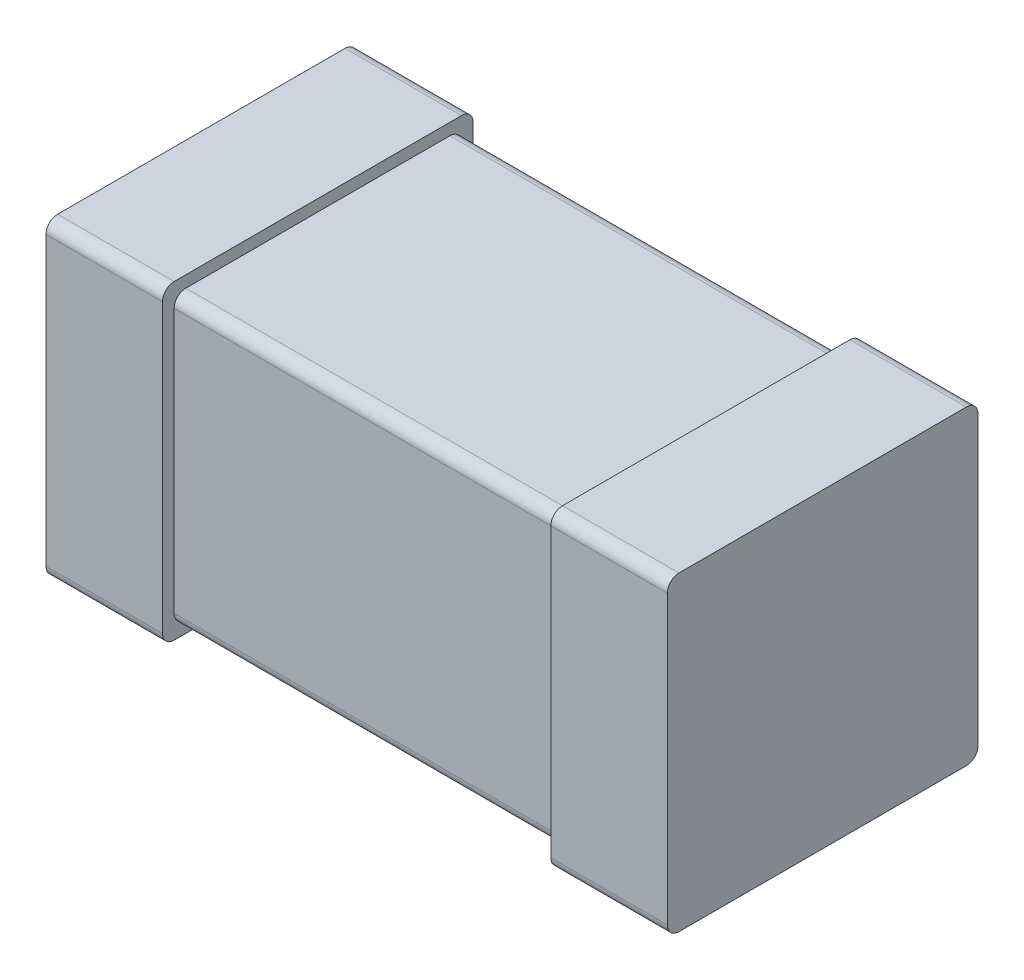
ISO-10303-21;
HEADER;
FILE_DESCRIPTION(('STEP AP214'),'2;1');
FILE_NAME('part.step','',(''),(''),'','','');
FILE_SCHEMA(('AUTOMOTIVE_DESIGN { 1 0 10303 214 1 1 1 1 }'));
ENDSEC;
DATA;
#1=APPLICATION_CONTEXT('core data for automotive mechanical design processes');
#2=APPLICATION_PROTOCOL_DEFINITION('international standard','automotive_design',2000,#1);
#3=PRODUCT_CONTEXT('',#1,'mechanical');
#4=PRODUCT('Part','Part','',(#3));
#5=PRODUCT_RELATED_PRODUCT_CATEGORY('part','',(#4));
#6=PRODUCT_DEFINITION_FORMATION('','',#4);
#7=PRODUCT_DEFINITION_CONTEXT('part definition',#1,'design');
#8=PRODUCT_DEFINITION('design','',#6,#7);
#9=PRODUCT_DEFINITION_SHAPE('','',#8);
#10=(LENGTH_UNIT() NAMED_UNIT(*) SI_UNIT(.MILLI.,.METRE.));
#11=(NAMED_UNIT(*) PLANE_ANGLE_UNIT() SI_UNIT($,.RADIAN.));
#12=(NAMED_UNIT(*) SI_UNIT($,.STERADIAN.) SOLID_ANGLE_UNIT());
#13=UNCERTAINTY_MEASURE_WITH_UNIT(LENGTH_MEASURE(1.E-05),#10,'distance_accuracy_value','');
#14=(GEOMETRIC_REPRESENTATION_CONTEXT(3) GLOBAL_UNCERTAINTY_ASSIGNED_CONTEXT((#13)) GLOBAL_UNIT_ASSIGNED_CONTEXT((#10,
#11,#12)) REPRESENTATION_CONTEXT('',''));
#15=CARTESIAN_POINT('',(0.,0.,0.));
#16=DIRECTION('',(0.,0.,1.));
#17=DIRECTION('',(1.,0.,0.));
#18=AXIS2_PLACEMENT_3D('',#15,#16,#17);
#19=CARTESIAN_POINT('',(-0.8,-0.4,0.));
#20=DIRECTION('',(1.,0.,0.));
#21=DIRECTION('',(0.,0.,-1.));
#22=AXIS2_PLACEMENT_3D('',#19,#20,#21);
#23=PLANE('',#22);
#24=DIRECTION('',(0.,1.,0.));
#25=VECTOR('',#24,1.);
#26=CARTESIAN_POINT('',(-0.8,-0.4,0.8));
#27=LINE('',#26,#25);
#28=CARTESIAN_POINT('',(-0.8,0.37,0.8));
#29=VERTEX_POINT('',#28);
#30=CARTESIAN_POINT('',(-0.8,-0.37,0.8));
#31=VERTEX_POINT('',#30);
#32=EDGE_CURVE('E300',#29,#31,#27,.F.);
#33=ORIENTED_EDGE('',*,*,#32,.F.);
#34=CARTESIAN_POINT('',(-0.8,0.37,0.77));
#35=DIRECTION('',(1.,0.,0.));
#36=DIRECTION('',(0.,0.,-1.));
#37=AXIS2_PLACEMENT_3D('',#34,#35,#36);
#38=CIRCLE('',#37,0.03);
#39=CARTESIAN_POINT('',(-0.8,0.4,0.77));
#40=VERTEX_POINT('',#39);
#41=EDGE_CURVE('E279',#40,#29,#38,.T.);
#42=ORIENTED_EDGE('',*,*,#41,.F.);
#43=DIRECTION('',(0.,0.,1.));
#44=VECTOR('',#43,1.);
#45=CARTESIAN_POINT('',(-0.8,0.4,0.));
#46=LINE('',#45,#44);
#47=CARTESIAN_POINT('',(-0.8,0.4,0.03));
#48=VERTEX_POINT('',#47);
#49=EDGE_CURVE('E201',#48,#40,#46,.T.);
#50=ORIENTED_EDGE('',*,*,#49,.F.);
#51=CARTESIAN_POINT('',(-0.8,0.37,0.03));
#52=DIRECTION('',(1.,0.,0.));
#53=DIRECTION('',(0.,0.,-1.));
#54=AXIS2_PLACEMENT_3D('',#51,#52,#53);
#55=CIRCLE('',#54,0.03);
#56=CARTESIAN_POINT('',(-0.8,0.37,0.));
#57=VERTEX_POINT('',#56);
#58=EDGE_CURVE('E196',#57,#48,#55,.T.);
#59=ORIENTED_EDGE('',*,*,#58,.F.);
#60=DIRECTION('',(0.,1.,0.));
#61=VECTOR('',#60,1.);
#62=CARTESIAN_POINT('',(-0.8,-0.4,0.));
#63=LINE('',#62,#61);
#64=CARTESIAN_POINT('',(-0.8,-0.37,0.));
#65=VERTEX_POINT('',#64);
#66=EDGE_CURVE('E188',#57,#65,#63,.F.);
#67=ORIENTED_EDGE('',*,*,#66,.T.);
#68=CARTESIAN_POINT('',(-0.8,-0.37,0.03));
#69=DIRECTION('',(1.,0.,0.));
#70=DIRECTION('',(0.,0.,-1.));
#71=AXIS2_PLACEMENT_3D('',#68,#69,#70);
#72=CIRCLE('',#71,0.03);
#73=CARTESIAN_POINT('',(-0.8,-0.4,0.03));
#74=VERTEX_POINT('',#73);
#75=EDGE_CURVE('E20',#74,#65,#72,.T.);
#76=ORIENTED_EDGE('',*,*,#75,.F.);
#77=DIRECTION('',(0.,0.,1.));
#78=VECTOR('',#77,1.);
#79=CARTESIAN_POINT('',(-0.8,-0.4,0.));
#80=LINE('',#79,#78);
#81=CARTESIAN_POINT('',(-0.8,-0.4,0.77));
#82=VERTEX_POINT('',#81);
#83=EDGE_CURVE('E171',#74,#82,#80,.T.);
#84=ORIENTED_EDGE('',*,*,#83,.T.);
#85=CARTESIAN_POINT('',(-0.8,-0.37,0.77));
#86=DIRECTION('',(1.,0.,0.));
#87=DIRECTION('',(0.,0.,-1.));
#88=AXIS2_PLACEMENT_3D('',#85,#86,#87);
#89=CIRCLE('',#88,0.03);
#90=EDGE_CURVE('E275',#31,#82,#89,.T.);
#91=ORIENTED_EDGE('',*,*,#90,.F.);
#92=EDGE_LOOP('',(#33,#42,#50,#59,#67,#76,#84,#91));
#93=FACE_BOUND('',#92,.T.);
#94=ADVANCED_FACE('F17',(#93),#23,.F.);
#95=CARTESIAN_POINT('',(0.8,-0.4,0.));
#96=DIRECTION('',(1.,0.,0.));
#97=DIRECTION('',(0.,0.,-1.));
#98=AXIS2_PLACEMENT_3D('',#95,#96,#97);
#99=PLANE('',#98);
#100=DIRECTION('',(0.,1.,0.));
#101=VECTOR('',#100,1.);
#102=CARTESIAN_POINT('',(0.8,-0.4,0.8));
#103=LINE('',#102,#101);
#104=CARTESIAN_POINT('',(0.8,-0.37,0.8));
#105=VERTEX_POINT('',#104);
#106=CARTESIAN_POINT('',(0.8,0.37,0.8));
#107=VERTEX_POINT('',#106);
#108=EDGE_CURVE('E290',#105,#107,#103,.T.);
#109=ORIENTED_EDGE('',*,*,#108,.F.);
#110=CARTESIAN_POINT('',(0.8,-0.37,0.77));
#111=DIRECTION('',(1.,0.,0.));
#112=DIRECTION('',(0.,0.,-1.));
#113=AXIS2_PLACEMENT_3D('',#110,#111,#112);
#114=CIRCLE('',#113,0.03);
#115=CARTESIAN_POINT('',(0.8,-0.4,0.77));
#116=VERTEX_POINT('',#115);
#117=EDGE_CURVE('E259',#116,#105,#114,.F.);
#118=ORIENTED_EDGE('',*,*,#117,.F.);
#119=DIRECTION('',(0.,0.,1.));
#120=VECTOR('',#119,1.);
#121=CARTESIAN_POINT('',(0.8,-0.4,0.));
#122=LINE('',#121,#120);
#123=CARTESIAN_POINT('',(0.8,-0.4,0.03));
#124=VERTEX_POINT('',#123);
#125=EDGE_CURVE('E274',#116,#124,#122,.F.);
#126=ORIENTED_EDGE('',*,*,#125,.T.);
#127=CARTESIAN_POINT('',(0.8,-0.37,0.03));
#128=DIRECTION('',(1.,0.,0.));
#129=DIRECTION('',(0.,0.,-1.));
#130=AXIS2_PLACEMENT_3D('',#127,#128,#129);
#131=CIRCLE('',#130,0.03);
#132=CARTESIAN_POINT('',(0.8,-0.37,0.));
#133=VERTEX_POINT('',#132);
#134=EDGE_CURVE('E271',#133,#124,#131,.F.);
#135=ORIENTED_EDGE('',*,*,#134,.F.);
#136=DIRECTION('',(0.,1.,0.));
#137=VECTOR('',#136,1.);
#138=CARTESIAN_POINT('',(0.8,-0.4,0.));
#139=LINE('',#138,#137);
#140=CARTESIAN_POINT('',(0.8,0.37,0.));
#141=VERTEX_POINT('',#140);
#142=EDGE_CURVE('E270',#133,#141,#139,.T.);
#143=ORIENTED_EDGE('',*,*,#142,.T.);
#144=CARTESIAN_POINT('',(0.8,0.37,0.03));
#145=DIRECTION('',(1.,0.,0.));
#146=DIRECTION('',(0.,0.,-1.));
#147=AXIS2_PLACEMENT_3D('',#144,#145,#146);
#148=CIRCLE('',#147,0.03);
#149=CARTESIAN_POINT('',(0.8,0.4,0.03));
#150=VERTEX_POINT('',#149);
#151=EDGE_CURVE('E267',#150,#141,#148,.F.);
#152=ORIENTED_EDGE('',*,*,#151,.F.);
#153=DIRECTION('',(0.,0.,1.));
#154=VECTOR('',#153,1.);
#155=CARTESIAN_POINT('',(0.8,0.4,0.));
#156=LINE('',#155,#154);
#157=CARTESIAN_POINT('',(0.8,0.4,0.77));
#158=VERTEX_POINT('',#157);
#159=EDGE_CURVE('E295',#158,#150,#156,.F.);
#160=ORIENTED_EDGE('',*,*,#159,.F.);
#161=CARTESIAN_POINT('',(0.8,0.37,0.77));
#162=DIRECTION('',(1.,0.,0.));
#163=DIRECTION('',(0.,0.,-1.));
#164=AXIS2_PLACEMENT_3D('',#161,#162,#163);
#165=CIRCLE('',#164,0.03);
#166=EDGE_CURVE('E263',#107,#158,#165,.F.);
#167=ORIENTED_EDGE('',*,*,#166,.F.);
#168=EDGE_LOOP('',(#109,#118,#126,#135,#143,#152,#160,#167));
#169=FACE_BOUND('',#168,.T.);
#170=ADVANCED_FACE('F444',(#169),#99,.T.);
#171=CARTESIAN_POINT('',(-0.8,-0.4,0.));
#172=DIRECTION('',(0.,1.,0.));
#173=DIRECTION('',(0.,0.,1.));
#174=AXIS2_PLACEMENT_3D('',#171,#172,#173);
#175=PLANE('',#174);
#176=ORIENTED_EDGE('',*,*,#83,.F.);
#177=DIRECTION('',(1.,0.,0.));
#178=VECTOR('',#177,1.);
#179=CARTESIAN_POINT('',(-0.8,-0.4,0.03));
#180=LINE('',#179,#178);
#181=CARTESIAN_POINT('',(-0.5,-0.4,0.03));
#182=VERTEX_POINT('',#181);
#183=EDGE_CURVE('E182',#182,#74,#180,.F.);
#184=ORIENTED_EDGE('',*,*,#183,.F.);
#185=DIRECTION('',(0.,0.,-1.));
#186=VECTOR('',#185,1.);
#187=CARTESIAN_POINT('',(-0.5,-0.4,0.));
#188=LINE('',#187,#186);
#189=CARTESIAN_POINT('',(-0.5,-0.4,0.77));
#190=VERTEX_POINT('',#189);
#191=EDGE_CURVE('E258',#190,#182,#188,.T.);
#192=ORIENTED_EDGE('',*,*,#191,.F.);
#193=DIRECTION('',(1.,0.,0.));
#194=VECTOR('',#193,1.);
#195=CARTESIAN_POINT('',(-0.8,-0.4,0.77));
#196=LINE('',#195,#194);
#197=EDGE_CURVE('E307',#82,#190,#196,.T.);
#198=ORIENTED_EDGE('',*,*,#197,.F.);
#199=EDGE_LOOP('',(#176,#184,#192,#198));
#200=FACE_BOUND('',#199,.T.);
#201=ADVANCED_FACE('F310',(#200),#175,.F.);
#202=CARTESIAN_POINT('',(-0.8,-0.37,0.03));
#203=DIRECTION('',(1.,0.,0.));
#204=DIRECTION('',(0.,0.,-1.));
#205=AXIS2_PLACEMENT_3D('',#202,#203,#204);
#206=CYLINDRICAL_SURFACE('',#205,0.03);
#207=CARTESIAN_POINT('',(-0.5,-0.37,0.03));
#208=DIRECTION('',(1.,0.,0.));
#209=DIRECTION('',(0.,0.,-1.));
#210=AXIS2_PLACEMENT_3D('',#207,#208,#209);
#211=CIRCLE('',#210,0.03);
#212=CARTESIAN_POINT('',(-0.5,-0.37,0.));
#213=VERTEX_POINT('',#212);
#214=EDGE_CURVE('E256',#182,#213,#211,.T.);
#215=ORIENTED_EDGE('',*,*,#214,.F.);
#216=ORIENTED_EDGE('',*,*,#183,.T.);
#217=ORIENTED_EDGE('',*,*,#75,.T.);
#218=DIRECTION('',(1.,0.,0.));
#219=VECTOR('',#218,1.);
#220=CARTESIAN_POINT('',(-0.8,-0.37,0.));
#221=LINE('',#220,#219);
#222=EDGE_CURVE('E180',#65,#213,#221,.T.);
#223=ORIENTED_EDGE('',*,*,#222,.T.);
#224=EDGE_LOOP('',(#215,#216,#217,#223));
#225=FACE_BOUND('',#224,.T.);
#226=ADVANCED_FACE('F179',(#225),#206,.T.);
#227=CARTESIAN_POINT('',(-0.8,-0.4,0.));
#228=DIRECTION('',(0.,0.,1.));
#229=DIRECTION('',(1.,0.,0.));
#230=AXIS2_PLACEMENT_3D('',#227,#228,#229);
#231=PLANE('',#230);
#232=DIRECTION('',(0.,1.,0.));
#233=VECTOR('',#232,1.);
#234=CARTESIAN_POINT('',(-0.5,-0.4,0.));
#235=LINE('',#234,#233);
#236=CARTESIAN_POINT('',(-0.5,0.37,0.));
#237=VERTEX_POINT('',#236);
#238=EDGE_CURVE('E190',#213,#237,#235,.T.);
#239=ORIENTED_EDGE('',*,*,#238,.F.);
#240=ORIENTED_EDGE('',*,*,#222,.F.);
#241=ORIENTED_EDGE('',*,*,#66,.F.);
#242=DIRECTION('',(1.,0.,0.));
#243=VECTOR('',#242,1.);
#244=CARTESIAN_POINT('',(-0.8,0.37,0.));
#245=LINE('',#244,#243);
#246=EDGE_CURVE('E191',#237,#57,#245,.F.);
#247=ORIENTED_EDGE('',*,*,#246,.F.);
#248=EDGE_LOOP('',(#239,#240,#241,#247));
#249=FACE_BOUND('',#248,.T.);
#250=ADVANCED_FACE('F186',(#249),#231,.F.);
#251=CARTESIAN_POINT('',(-0.8,0.37,0.03));
#252=DIRECTION('',(1.,0.,0.));
#253=DIRECTION('',(0.,0.,-1.));
#254=AXIS2_PLACEMENT_3D('',#251,#252,#253);
#255=CYLINDRICAL_SURFACE('',#254,0.03);
#256=ORIENTED_EDGE('',*,*,#246,.T.);
#257=ORIENTED_EDGE('',*,*,#58,.T.);
#258=DIRECTION('',(1.,0.,0.));
#259=VECTOR('',#258,1.);
#260=CARTESIAN_POINT('',(-0.8,0.4,0.03));
#261=LINE('',#260,#259);
#262=CARTESIAN_POINT('',(-0.5,0.4,0.03));
#263=VERTEX_POINT('',#262);
#264=EDGE_CURVE('E281',#263,#48,#261,.F.);
#265=ORIENTED_EDGE('',*,*,#264,.F.);
#266=CARTESIAN_POINT('',(-0.5,0.37,0.03));
#267=DIRECTION('',(1.,0.,0.));
#268=DIRECTION('',(0.,0.,-1.));
#269=AXIS2_PLACEMENT_3D('',#266,#267,#268);
#270=CIRCLE('',#269,0.03);
#271=EDGE_CURVE('E254',#237,#263,#270,.T.);
#272=ORIENTED_EDGE('',*,*,#271,.F.);
#273=EDGE_LOOP('',(#256,#257,#265,#272));
#274=FACE_BOUND('',#273,.T.);
#275=ADVANCED_FACE('F679',(#274),#255,.T.);
#276=CARTESIAN_POINT('',(-0.8,0.4,0.));
#277=DIRECTION('',(0.,1.,0.));
#278=DIRECTION('',(0.,0.,1.));
#279=AXIS2_PLACEMENT_3D('',#276,#277,#278);
#280=PLANE('',#279);
#281=ORIENTED_EDGE('',*,*,#49,.T.);
#282=DIRECTION('',(1.,0.,0.));
#283=VECTOR('',#282,1.);
#284=CARTESIAN_POINT('',(-0.8,0.4,0.77));
#285=LINE('',#284,#283);
#286=CARTESIAN_POINT('',(-0.5,0.4,0.77));
#287=VERTEX_POINT('',#286);
#288=EDGE_CURVE('E280',#287,#40,#285,.F.);
#289=ORIENTED_EDGE('',*,*,#288,.F.);
#290=DIRECTION('',(0.,0.,-1.));
#291=VECTOR('',#290,1.);
#292=CARTESIAN_POINT('',(-0.5,0.4,0.));
#293=LINE('',#292,#291);
#294=EDGE_CURVE('E253',#263,#287,#293,.F.);
#295=ORIENTED_EDGE('',*,*,#294,.F.);
#296=ORIENTED_EDGE('',*,*,#264,.T.);
#297=EDGE_LOOP('',(#281,#289,#295,#296));
#298=FACE_BOUND('',#297,.T.);
#299=ADVANCED_FACE('F671',(#298),#280,.T.);
#300=CARTESIAN_POINT('',(-0.8,0.37,0.77));
#301=DIRECTION('',(1.,0.,0.));
#302=DIRECTION('',(0.,0.,-1.));
#303=AXIS2_PLACEMENT_3D('',#300,#301,#302);
#304=CYLINDRICAL_SURFACE('',#303,0.03);
#305=CARTESIAN_POINT('',(-0.5,0.37,0.77));
#306=DIRECTION('',(1.,0.,0.));
#307=DIRECTION('',(0.,0.,-1.));
#308=AXIS2_PLACEMENT_3D('',#305,#306,#307);
#309=CIRCLE('',#308,0.03);
#310=CARTESIAN_POINT('',(-0.5,0.37,0.8));
#311=VERTEX_POINT('',#310);
#312=EDGE_CURVE('E251',#287,#311,#309,.T.);
#313=ORIENTED_EDGE('',*,*,#312,.F.);
#314=ORIENTED_EDGE('',*,*,#288,.T.);
#315=ORIENTED_EDGE('',*,*,#41,.T.);
#316=DIRECTION('',(1.,0.,0.));
#317=VECTOR('',#316,1.);
#318=CARTESIAN_POINT('',(-0.8,0.37,0.8));
#319=LINE('',#318,#317);
#320=EDGE_CURVE('E301',#311,#29,#319,.F.);
#321=ORIENTED_EDGE('',*,*,#320,.F.);
#322=EDGE_LOOP('',(#313,#314,#315,#321));
#323=FACE_BOUND('',#322,.T.);
#324=ADVANCED_FACE('F322',(#323),#304,.T.);
#325=CARTESIAN_POINT('',(-0.8,-0.4,0.8));
#326=DIRECTION('',(0.,0.,1.));
#327=DIRECTION('',(1.,0.,0.));
#328=AXIS2_PLACEMENT_3D('',#325,#326,#327);
#329=PLANE('',#328);
#330=DIRECTION('',(0.,1.,0.));
#331=VECTOR('',#330,1.);
#332=CARTESIAN_POINT('',(-0.5,-0.4,0.8));
#333=LINE('',#332,#331);
#334=CARTESIAN_POINT('',(-0.5,-0.37,0.8));
#335=VERTEX_POINT('',#334);
#336=EDGE_CURVE('E250',#311,#335,#333,.F.);
#337=ORIENTED_EDGE('',*,*,#336,.F.);
#338=ORIENTED_EDGE('',*,*,#320,.T.);
#339=ORIENTED_EDGE('',*,*,#32,.T.);
#340=DIRECTION('',(1.,0.,0.));
#341=VECTOR('',#340,1.);
#342=CARTESIAN_POINT('',(-0.8,-0.37,0.8));
#343=LINE('',#342,#341);
#344=EDGE_CURVE('E278',#335,#31,#343,.F.);
#345=ORIENTED_EDGE('',*,*,#344,.F.);
#346=EDGE_LOOP('',(#337,#338,#339,#345));
#347=FACE_BOUND('',#346,.T.);
#348=ADVANCED_FACE('F328',(#347),#329,.T.);
#349=CARTESIAN_POINT('',(-0.8,-0.37,0.77));
#350=DIRECTION('',(1.,0.,0.));
#351=DIRECTION('',(0.,0.,-1.));
#352=AXIS2_PLACEMENT_3D('',#349,#350,#351);
#353=CYLINDRICAL_SURFACE('',#352,0.03);
#354=ORIENTED_EDGE('',*,*,#344,.T.);
#355=ORIENTED_EDGE('',*,*,#90,.T.);
#356=ORIENTED_EDGE('',*,*,#197,.T.);
#357=CARTESIAN_POINT('',(-0.5,-0.37,0.77));
#358=DIRECTION('',(1.,0.,0.));
#359=DIRECTION('',(0.,0.,-1.));
#360=AXIS2_PLACEMENT_3D('',#357,#358,#359);
#361=CIRCLE('',#360,0.03);
#362=EDGE_CURVE('E247',#335,#190,#361,.T.);
#363=ORIENTED_EDGE('',*,*,#362,.F.);
#364=EDGE_LOOP('',(#354,#355,#356,#363));
#365=FACE_BOUND('',#364,.T.);
#366=ADVANCED_FACE('F305',(#365),#353,.T.);
#367=CARTESIAN_POINT('',(0.5,-0.4,0.));
#368=DIRECTION('',(0.,1.,0.));
#369=DIRECTION('',(0.,0.,1.));
#370=AXIS2_PLACEMENT_3D('',#367,#368,#369);
#371=PLANE('',#370);
#372=DIRECTION('',(0.,0.,-1.));
#373=VECTOR('',#372,1.);
#374=CARTESIAN_POINT('',(0.5,-0.4,0.));
#375=LINE('',#374,#373);
#376=CARTESIAN_POINT('',(0.5,-0.4,0.77));
#377=VERTEX_POINT('',#376);
#378=CARTESIAN_POINT('',(0.5,-0.4,0.03));
#379=VERTEX_POINT('',#378);
#380=EDGE_CURVE('E236',#377,#379,#375,.T.);
#381=ORIENTED_EDGE('',*,*,#380,.T.);
#382=DIRECTION('',(1.,0.,0.));
#383=VECTOR('',#382,1.);
#384=CARTESIAN_POINT('',(0.5,-0.4,0.03));
#385=LINE('',#384,#383);
#386=EDGE_CURVE('E273',#124,#379,#385,.F.);
#387=ORIENTED_EDGE('',*,*,#386,.F.);
#388=ORIENTED_EDGE('',*,*,#125,.F.);
#389=DIRECTION('',(1.,0.,0.));
#390=VECTOR('',#389,1.);
#391=CARTESIAN_POINT('',(0.5,-0.4,0.77));
#392=LINE('',#391,#390);
#393=EDGE_CURVE('E262',#377,#116,#392,.T.);
#394=ORIENTED_EDGE('',*,*,#393,.F.);
#395=EDGE_LOOP('',(#381,#387,#388,#394));
#396=FACE_BOUND('',#395,.T.);
#397=ADVANCED_FACE('F369',(#396),#371,.F.);
#398=CARTESIAN_POINT('',(0.5,-0.37,0.03));
#399=DIRECTION('',(1.,0.,0.));
#400=DIRECTION('',(0.,0.,-1.));
#401=AXIS2_PLACEMENT_3D('',#398,#399,#400);
#402=CYLINDRICAL_SURFACE('',#401,0.03);
#403=ORIENTED_EDGE('',*,*,#134,.T.);
#404=ORIENTED_EDGE('',*,*,#386,.T.);
#405=CARTESIAN_POINT('',(0.5,-0.37,0.03));
#406=DIRECTION('',(1.,0.,0.));
#407=DIRECTION('',(0.,0.,-1.));
#408=AXIS2_PLACEMENT_3D('',#405,#406,#407);
#409=CIRCLE('',#408,0.03);
#410=CARTESIAN_POINT('',(0.5,-0.37,0.));
#411=VERTEX_POINT('',#410);
#412=EDGE_CURVE('E233',#379,#411,#409,.T.);
#413=ORIENTED_EDGE('',*,*,#412,.T.);
#414=DIRECTION('',(1.,0.,0.));
#415=VECTOR('',#414,1.);
#416=CARTESIAN_POINT('',(0.5,-0.37,0.));
#417=LINE('',#416,#415);
#418=EDGE_CURVE('E299',#411,#133,#417,.T.);
#419=ORIENTED_EDGE('',*,*,#418,.T.);
#420=EDGE_LOOP('',(#403,#404,#413,#419));
#421=FACE_BOUND('',#420,.T.);
#422=ADVANCED_FACE('F358',(#421),#402,.T.);
#423=CARTESIAN_POINT('',(0.5,-0.4,0.));
#424=DIRECTION('',(0.,0.,1.));
#425=DIRECTION('',(1.,0.,0.));
#426=AXIS2_PLACEMENT_3D('',#423,#424,#425);
#427=PLANE('',#426);
#428=ORIENTED_EDGE('',*,*,#142,.F.);
#429=ORIENTED_EDGE('',*,*,#418,.F.);
#430=DIRECTION('',(0.,1.,0.));
#431=VECTOR('',#430,1.);
#432=CARTESIAN_POINT('',(0.5,-0.4,0.));
#433=LINE('',#432,#431);
#434=CARTESIAN_POINT('',(0.5,0.37,0.));
#435=VERTEX_POINT('',#434);
#436=EDGE_CURVE('E232',#411,#435,#433,.T.);
#437=ORIENTED_EDGE('',*,*,#436,.T.);
#438=DIRECTION('',(1.,0.,0.));
#439=VECTOR('',#438,1.);
#440=CARTESIAN_POINT('',(0.5,0.37,0.));
#441=LINE('',#440,#439);
#442=EDGE_CURVE('E269',#141,#435,#441,.F.);
#443=ORIENTED_EDGE('',*,*,#442,.F.);
#444=EDGE_LOOP('',(#428,#429,#437,#443));
#445=FACE_BOUND('',#444,.T.);
#446=ADVANCED_FACE('F441',(#445),#427,.F.);
#447=CARTESIAN_POINT('',(0.5,0.37,0.03));
#448=DIRECTION('',(1.,0.,0.));
#449=DIRECTION('',(0.,0.,-1.));
#450=AXIS2_PLACEMENT_3D('',#447,#448,#449);
#451=CYLINDRICAL_SURFACE('',#450,0.03);
#452=ORIENTED_EDGE('',*,*,#442,.T.);
#453=CARTESIAN_POINT('',(0.5,0.37,0.03));
#454=DIRECTION('',(1.,0.,0.));
#455=DIRECTION('',(0.,0.,-1.));
#456=AXIS2_PLACEMENT_3D('',#453,#454,#455);
#457=CIRCLE('',#456,0.03);
#458=CARTESIAN_POINT('',(0.5,0.4,0.03));
#459=VERTEX_POINT('',#458);
#460=EDGE_CURVE('E229',#435,#459,#457,.T.);
#461=ORIENTED_EDGE('',*,*,#460,.T.);
#462=DIRECTION('',(1.,0.,0.));
#463=VECTOR('',#462,1.);
#464=CARTESIAN_POINT('',(0.5,0.4,0.03));
#465=LINE('',#464,#463);
#466=EDGE_CURVE('E266',#150,#459,#465,.F.);
#467=ORIENTED_EDGE('',*,*,#466,.F.);
#468=ORIENTED_EDGE('',*,*,#151,.T.);
#469=EDGE_LOOP('',(#452,#461,#467,#468));
#470=FACE_BOUND('',#469,.T.);
#471=ADVANCED_FACE('F436',(#470),#451,.T.);
#472=CARTESIAN_POINT('',(0.5,0.4,0.));
#473=DIRECTION('',(0.,1.,0.));
#474=DIRECTION('',(0.,0.,1.));
#475=AXIS2_PLACEMENT_3D('',#472,#473,#474);
#476=PLANE('',#475);
#477=DIRECTION('',(0.,0.,-1.));
#478=VECTOR('',#477,1.);
#479=CARTESIAN_POINT('',(0.5,0.4,0.));
#480=LINE('',#479,#478);
#481=CARTESIAN_POINT('',(0.5,0.4,0.77));
#482=VERTEX_POINT('',#481);
#483=EDGE_CURVE('E228',#459,#482,#480,.F.);
#484=ORIENTED_EDGE('',*,*,#483,.T.);
#485=DIRECTION('',(1.,0.,0.));
#486=VECTOR('',#485,1.);
#487=CARTESIAN_POINT('',(0.5,0.4,0.77));
#488=LINE('',#487,#486);
#489=EDGE_CURVE('E265',#158,#482,#488,.F.);
#490=ORIENTED_EDGE('',*,*,#489,.F.);
#491=ORIENTED_EDGE('',*,*,#159,.T.);
#492=ORIENTED_EDGE('',*,*,#466,.T.);
#493=EDGE_LOOP('',(#484,#490,#491,#492));
#494=FACE_BOUND('',#493,.T.);
#495=ADVANCED_FACE('F432',(#494),#476,.T.);
#496=CARTESIAN_POINT('',(0.5,0.37,0.77));
#497=DIRECTION('',(1.,0.,0.));
#498=DIRECTION('',(0.,0.,-1.));
#499=AXIS2_PLACEMENT_3D('',#496,#497,#498);
#500=CYLINDRICAL_SURFACE('',#499,0.03);
#501=ORIENTED_EDGE('',*,*,#166,.T.);
#502=ORIENTED_EDGE('',*,*,#489,.T.);
#503=CARTESIAN_POINT('',(0.5,0.37,0.77));
#504=DIRECTION('',(1.,0.,0.));
#505=DIRECTION('',(0.,0.,-1.));
#506=AXIS2_PLACEMENT_3D('',#503,#504,#505);
#507=CIRCLE('',#506,0.03);
#508=CARTESIAN_POINT('',(0.5,0.37,0.8));
#509=VERTEX_POINT('',#508);
#510=EDGE_CURVE('E225',#482,#509,#507,.T.);
#511=ORIENTED_EDGE('',*,*,#510,.T.);
#512=DIRECTION('',(1.,0.,0.));
#513=VECTOR('',#512,1.);
#514=CARTESIAN_POINT('',(0.5,0.37,0.8));
#515=LINE('',#514,#513);
#516=EDGE_CURVE('E292',#107,#509,#515,.F.);
#517=ORIENTED_EDGE('',*,*,#516,.F.);
#518=EDGE_LOOP('',(#501,#502,#511,#517));
#519=FACE_BOUND('',#518,.T.);
#520=ADVANCED_FACE('F455',(#519),#500,.T.);
#521=CARTESIAN_POINT('',(0.5,-0.4,0.8));
#522=DIRECTION('',(0.,0.,1.));
#523=DIRECTION('',(1.,0.,0.));
#524=AXIS2_PLACEMENT_3D('',#521,#522,#523);
#525=PLANE('',#524);
#526=ORIENTED_EDGE('',*,*,#108,.T.);
#527=ORIENTED_EDGE('',*,*,#516,.T.);
#528=DIRECTION('',(0.,1.,0.));
#529=VECTOR('',#528,1.);
#530=CARTESIAN_POINT('',(0.5,-0.4,0.8));
#531=LINE('',#530,#529);
#532=CARTESIAN_POINT('',(0.5,-0.37,0.8));
#533=VERTEX_POINT('',#532);
#534=EDGE_CURVE('E224',#509,#533,#531,.F.);
#535=ORIENTED_EDGE('',*,*,#534,.T.);
#536=DIRECTION('',(1.,0.,0.));
#537=VECTOR('',#536,1.);
#538=CARTESIAN_POINT('',(0.5,-0.37,0.8));
#539=LINE('',#538,#537);
#540=EDGE_CURVE('E261',#105,#533,#539,.F.);
#541=ORIENTED_EDGE('',*,*,#540,.F.);
#542=EDGE_LOOP('',(#526,#527,#535,#541));
#543=FACE_BOUND('',#542,.T.);
#544=ADVANCED_FACE('F451',(#543),#525,.T.);
#545=CARTESIAN_POINT('',(0.5,-0.37,0.77));
#546=DIRECTION('',(1.,0.,0.));
#547=DIRECTION('',(0.,0.,-1.));
#548=AXIS2_PLACEMENT_3D('',#545,#546,#547);
#549=CYLINDRICAL_SURFACE('',#548,0.03);
#550=ORIENTED_EDGE('',*,*,#540,.T.);
#551=CARTESIAN_POINT('',(0.5,-0.37,0.77));
#552=DIRECTION('',(1.,0.,0.));
#553=DIRECTION('',(0.,0.,-1.));
#554=AXIS2_PLACEMENT_3D('',#551,#552,#553);
#555=CIRCLE('',#554,0.03);
#556=EDGE_CURVE('E221',#533,#377,#555,.T.);
#557=ORIENTED_EDGE('',*,*,#556,.T.);
#558=ORIENTED_EDGE('',*,*,#393,.T.);
#559=ORIENTED_EDGE('',*,*,#117,.T.);
#560=EDGE_LOOP('',(#550,#557,#558,#559));
#561=FACE_BOUND('',#560,.T.);
#562=ADVANCED_FACE('F448',(#561),#549,.T.);
#563=CARTESIAN_POINT('',(-0.5,-0.37,0.03));
#564=DIRECTION('',(0.,1.,0.));
#565=DIRECTION('',(0.,0.,1.));
#566=AXIS2_PLACEMENT_3D('',#563,#564,#565);
#567=PLANE('',#566);
#568=DIRECTION('',(0.,0.,-1.));
#569=VECTOR('',#568,1.);
#570=CARTESIAN_POINT('',(-0.5,-0.37,0.));
#571=LINE('',#570,#569);
#572=CARTESIAN_POINT('',(-0.5,-0.37,0.06));
#573=VERTEX_POINT('',#572);
#574=CARTESIAN_POINT('',(-0.5,-0.37,0.74));
#575=VERTEX_POINT('',#574);
#576=EDGE_CURVE('E246',#573,#575,#571,.F.);
#577=ORIENTED_EDGE('',*,*,#576,.F.);
#578=DIRECTION('',(1.,0.,0.));
#579=VECTOR('',#578,1.);
#580=CARTESIAN_POINT('',(-0.5,-0.37,0.06));
#581=LINE('',#580,#579);
#582=CARTESIAN_POINT('',(0.5,-0.37,0.06));
#583=VERTEX_POINT('',#582);
#584=EDGE_CURVE('E239',#583,#573,#581,.F.);
#585=ORIENTED_EDGE('',*,*,#584,.F.);
#586=DIRECTION('',(0.,0.,-1.));
#587=VECTOR('',#586,1.);
#588=CARTESIAN_POINT('',(0.5,-0.37,0.));
#589=LINE('',#588,#587);
#590=CARTESIAN_POINT('',(0.5,-0.37,0.74));
#591=VERTEX_POINT('',#590);
#592=EDGE_CURVE('E217',#583,#591,#589,.F.);
#593=ORIENTED_EDGE('',*,*,#592,.T.);
#594=DIRECTION('',(1.,0.,0.));
#595=VECTOR('',#594,1.);
#596=CARTESIAN_POINT('',(-0.5,-0.37,0.74));
#597=LINE('',#596,#595);
#598=EDGE_CURVE('E344',#575,#591,#597,.T.);
#599=ORIENTED_EDGE('',*,*,#598,.F.);
#600=EDGE_LOOP('',(#577,#585,#593,#599));
#601=FACE_BOUND('',#600,.T.);
#602=ADVANCED_FACE('F420',(#601),#567,.F.);
#603=CARTESIAN_POINT('',(-0.5,-0.34,0.74));
#604=DIRECTION('',(1.,0.,0.));
#605=DIRECTION('',(0.,0.,-1.));
#606=AXIS2_PLACEMENT_3D('',#603,#604,#605);
#607=CYLINDRICAL_SURFACE('',#606,0.03);
#608=DIRECTION('',(1.,0.,0.));
#609=VECTOR('',#608,1.);
#610=CARTESIAN_POINT('',(-0.5,-0.34,0.77));
#611=LINE('',#610,#609);
#612=CARTESIAN_POINT('',(-0.5,-0.34,0.77));
#613=VERTEX_POINT('',#612);
#614=CARTESIAN_POINT('',(0.5,-0.34,0.77));
#615=VERTEX_POINT('',#614);
#616=EDGE_CURVE('E342',#613,#615,#611,.T.);
#617=ORIENTED_EDGE('',*,*,#616,.F.);
#618=CARTESIAN_POINT('',(-0.5,-0.34,0.74));
#619=DIRECTION('',(1.,0.,0.));
#620=DIRECTION('',(0.,0.,-1.));
#621=AXIS2_PLACEMENT_3D('',#618,#619,#620);
#622=CIRCLE('',#621,0.03);
#623=EDGE_CURVE('E244',#575,#613,#622,.F.);
#624=ORIENTED_EDGE('',*,*,#623,.F.);
#625=ORIENTED_EDGE('',*,*,#598,.T.);
#626=CARTESIAN_POINT('',(0.5,-0.34,0.74));
#627=DIRECTION('',(1.,0.,0.));
#628=DIRECTION('',(0.,0.,-1.));
#629=AXIS2_PLACEMENT_3D('',#626,#627,#628);
#630=CIRCLE('',#629,0.03);
#631=EDGE_CURVE('E214',#591,#615,#630,.F.);
#632=ORIENTED_EDGE('',*,*,#631,.T.);
#633=EDGE_LOOP('',(#617,#624,#625,#632));
#634=FACE_BOUND('',#633,.T.);
#635=ADVANCED_FACE('F422',(#634),#607,.T.);
#636=CARTESIAN_POINT('',(-0.5,-0.37,0.77));
#637=DIRECTION('',(0.,0.,1.));
#638=DIRECTION('',(1.,0.,0.));
#639=AXIS2_PLACEMENT_3D('',#636,#637,#638);
#640=PLANE('',#639);
#641=DIRECTION('',(0.,1.,0.));
#642=VECTOR('',#641,1.);
#643=CARTESIAN_POINT('',(0.5,-0.4,0.77));
#644=LINE('',#643,#642);
#645=CARTESIAN_POINT('',(0.5,0.34,0.77));
#646=VERTEX_POINT('',#645);
#647=EDGE_CURVE('E213',#615,#646,#644,.T.);
#648=ORIENTED_EDGE('',*,*,#647,.T.);
#649=DIRECTION('',(1.,0.,0.));
#650=VECTOR('',#649,1.);
#651=CARTESIAN_POINT('',(-0.5,0.34,0.77));
#652=LINE('',#651,#650);
#653=CARTESIAN_POINT('',(-0.5,0.34,0.77));
#654=VERTEX_POINT('',#653);
#655=EDGE_CURVE('E340',#654,#646,#652,.T.);
#656=ORIENTED_EDGE('',*,*,#655,.F.);
#657=DIRECTION('',(0.,1.,0.));
#658=VECTOR('',#657,1.);
#659=CARTESIAN_POINT('',(-0.5,-0.4,0.77));
#660=LINE('',#659,#658);
#661=EDGE_CURVE('E243',#613,#654,#660,.T.);
#662=ORIENTED_EDGE('',*,*,#661,.F.);
#663=ORIENTED_EDGE('',*,*,#616,.T.);
#664=EDGE_LOOP('',(#648,#656,#662,#663));
#665=FACE_BOUND('',#664,.T.);
#666=ADVANCED_FACE('F393',(#665),#640,.T.);
#667=CARTESIAN_POINT('',(-0.5,0.34,0.74));
#668=DIRECTION('',(1.,0.,0.));
#669=DIRECTION('',(0.,0.,-1.));
#670=AXIS2_PLACEMENT_3D('',#667,#668,#669);
#671=CYLINDRICAL_SURFACE('',#670,0.03);
#672=CARTESIAN_POINT('',(0.5,0.34,0.74));
#673=DIRECTION('',(1.,0.,0.));
#674=DIRECTION('',(0.,0.,-1.));
#675=AXIS2_PLACEMENT_3D('',#672,#673,#674);
#676=CIRCLE('',#675,0.03);
#677=CARTESIAN_POINT('',(0.5,0.37,0.74));
#678=VERTEX_POINT('',#677);
#679=EDGE_CURVE('E209',#646,#678,#676,.F.);
#680=ORIENTED_EDGE('',*,*,#679,.T.);
#681=DIRECTION('',(1.,0.,0.));
#682=VECTOR('',#681,1.);
#683=CARTESIAN_POINT('',(-0.5,0.37,0.74));
#684=LINE('',#683,#682);
#685=CARTESIAN_POINT('',(-0.5,0.37,0.74));
#686=VERTEX_POINT('',#685);
#687=EDGE_CURVE('E337',#686,#678,#684,.T.);
#688=ORIENTED_EDGE('',*,*,#687,.F.);
#689=CARTESIAN_POINT('',(-0.5,0.34,0.74));
#690=DIRECTION('',(1.,0.,0.));
#691=DIRECTION('',(0.,0.,-1.));
#692=AXIS2_PLACEMENT_3D('',#689,#690,#691);
#693=CIRCLE('',#692,0.03);
#694=EDGE_CURVE('E241',#654,#686,#693,.F.);
#695=ORIENTED_EDGE('',*,*,#694,.F.);
#696=ORIENTED_EDGE('',*,*,#655,.T.);
#697=EDGE_LOOP('',(#680,#688,#695,#696));
#698=FACE_BOUND('',#697,.T.);
#699=ADVANCED_FACE('F397',(#698),#671,.T.);
#700=CARTESIAN_POINT('',(-0.5,0.37,0.03));
#701=DIRECTION('',(0.,1.,0.));
#702=DIRECTION('',(0.,0.,1.));
#703=AXIS2_PLACEMENT_3D('',#700,#701,#702);
#704=PLANE('',#703);
#705=DIRECTION('',(0.,0.,-1.));
#706=VECTOR('',#705,1.);
#707=CARTESIAN_POINT('',(-0.5,0.37,0.));
#708=LINE('',#707,#706);
#709=CARTESIAN_POINT('',(-0.5,0.37,0.06));
#710=VERTEX_POINT('',#709);
#711=EDGE_CURVE('E240',#686,#710,#708,.T.);
#712=ORIENTED_EDGE('',*,*,#711,.F.);
#713=ORIENTED_EDGE('',*,*,#687,.T.);
#714=DIRECTION('',(0.,0.,-1.));
#715=VECTOR('',#714,1.);
#716=CARTESIAN_POINT('',(0.5,0.37,0.));
#717=LINE('',#716,#715);
#718=CARTESIAN_POINT('',(0.5,0.37,0.06));
#719=VERTEX_POINT('',#718);
#720=EDGE_CURVE('E212',#678,#719,#717,.T.);
#721=ORIENTED_EDGE('',*,*,#720,.T.);
#722=DIRECTION('',(1.,0.,0.));
#723=VECTOR('',#722,1.);
#724=CARTESIAN_POINT('',(-0.5,0.37,0.06));
#725=LINE('',#724,#723);
#726=EDGE_CURVE('E208',#710,#719,#725,.T.);
#727=ORIENTED_EDGE('',*,*,#726,.F.);
#728=EDGE_LOOP('',(#712,#713,#721,#727));
#729=FACE_BOUND('',#728,.T.);
#730=ADVANCED_FACE('F403',(#729),#704,.T.);
#731=CARTESIAN_POINT('',(-0.5,-0.4,0.));
#732=DIRECTION('',(1.,0.,0.));
#733=DIRECTION('',(0.,0.,-1.));
#734=AXIS2_PLACEMENT_3D('',#731,#732,#733);
#735=PLANE('',#734);
#736=CARTESIAN_POINT('',(-0.5,0.34,0.06));
#737=DIRECTION('',(1.,0.,0.));
#738=DIRECTION('',(0.,0.,-1.));
#739=AXIS2_PLACEMENT_3D('',#736,#737,#738);
#740=CIRCLE('',#739,0.03);
#741=CARTESIAN_POINT('',(-0.5,0.34,0.03));
#742=VERTEX_POINT('',#741);
#743=EDGE_CURVE('E203',#742,#710,#740,.T.);
#744=ORIENTED_EDGE('',*,*,#743,.F.);
#745=DIRECTION('',(0.,1.,0.));
#746=VECTOR('',#745,1.);
#747=CARTESIAN_POINT('',(-0.5,-0.37,0.03));
#748=LINE('',#747,#746);
#749=CARTESIAN_POINT('',(-0.5,-0.34,0.03));
#750=VERTEX_POINT('',#749);
#751=EDGE_CURVE('E206',#742,#750,#748,.F.);
#752=ORIENTED_EDGE('',*,*,#751,.T.);
#753=CARTESIAN_POINT('',(-0.5,-0.34,0.06));
#754=DIRECTION('',(1.,0.,0.));
#755=DIRECTION('',(0.,0.,-1.));
#756=AXIS2_PLACEMENT_3D('',#753,#754,#755);
#757=CIRCLE('',#756,0.03);
#758=EDGE_CURVE('E237',#573,#750,#757,.T.);
#759=ORIENTED_EDGE('',*,*,#758,.F.);
#760=ORIENTED_EDGE('',*,*,#576,.T.);
#761=ORIENTED_EDGE('',*,*,#623,.T.);
#762=ORIENTED_EDGE('',*,*,#661,.T.);
#763=ORIENTED_EDGE('',*,*,#694,.T.);
#764=ORIENTED_EDGE('',*,*,#711,.T.);
#765=EDGE_LOOP('',(#744,#752,#759,#760,#761,#762,#763,#764));
#766=FACE_BOUND('',#765,.T.);
#767=ORIENTED_EDGE('',*,*,#336,.T.);
#768=ORIENTED_EDGE('',*,*,#362,.T.);
#769=ORIENTED_EDGE('',*,*,#191,.T.);
#770=ORIENTED_EDGE('',*,*,#214,.T.);
#771=ORIENTED_EDGE('',*,*,#238,.T.);
#772=ORIENTED_EDGE('',*,*,#271,.T.);
#773=ORIENTED_EDGE('',*,*,#294,.T.);
#774=ORIENTED_EDGE('',*,*,#312,.T.);
#775=EDGE_LOOP('',(#767,#768,#769,#770,#771,#772,#773,#774));
#776=FACE_BOUND('',#775,.T.);
#777=ADVANCED_FACE('F386',(#766,#776),#735,.T.);
#778=CARTESIAN_POINT('',(-0.5,-0.34,0.06));
#779=DIRECTION('',(1.,0.,0.));
#780=DIRECTION('',(0.,0.,-1.));
#781=AXIS2_PLACEMENT_3D('',#778,#779,#780);
#782=CYLINDRICAL_SURFACE('',#781,0.03);
#783=CARTESIAN_POINT('',(0.5,-0.34,0.06));
#784=DIRECTION('',(1.,0.,0.));
#785=DIRECTION('',(0.,0.,-1.));
#786=AXIS2_PLACEMENT_3D('',#783,#784,#785);
#787=CIRCLE('',#786,0.03);
#788=CARTESIAN_POINT('',(0.5,-0.34,0.03));
#789=VERTEX_POINT('',#788);
#790=EDGE_CURVE('E218',#789,#583,#787,.F.);
#791=ORIENTED_EDGE('',*,*,#790,.T.);
#792=ORIENTED_EDGE('',*,*,#584,.T.);
#793=ORIENTED_EDGE('',*,*,#758,.T.);
#794=DIRECTION('',(1.,0.,0.));
#795=VECTOR('',#794,1.);
#796=CARTESIAN_POINT('',(-0.5,-0.34,0.03));
#797=LINE('',#796,#795);
#798=EDGE_CURVE('E374',#750,#789,#797,.T.);
#799=ORIENTED_EDGE('',*,*,#798,.T.);
#800=EDGE_LOOP('',(#791,#792,#793,#799));
#801=FACE_BOUND('',#800,.T.);
#802=ADVANCED_FACE('F416',(#801),#782,.T.);
#803=CARTESIAN_POINT('',(0.5,-0.4,0.));
#804=DIRECTION('',(1.,0.,0.));
#805=DIRECTION('',(0.,0.,-1.));
#806=AXIS2_PLACEMENT_3D('',#803,#804,#805);
#807=PLANE('',#806);
#808=CARTESIAN_POINT('',(0.5,0.34,0.06));
#809=DIRECTION('',(1.,0.,0.));
#810=DIRECTION('',(0.,0.,-1.));
#811=AXIS2_PLACEMENT_3D('',#808,#809,#810);
#812=CIRCLE('',#811,0.03);
#813=CARTESIAN_POINT('',(0.5,0.34,0.03));
#814=VERTEX_POINT('',#813);
#815=EDGE_CURVE('E34',#719,#814,#812,.F.);
#816=ORIENTED_EDGE('',*,*,#815,.F.);
#817=ORIENTED_EDGE('',*,*,#720,.F.);
#818=ORIENTED_EDGE('',*,*,#679,.F.);
#819=ORIENTED_EDGE('',*,*,#647,.F.);
#820=ORIENTED_EDGE('',*,*,#631,.F.);
#821=ORIENTED_EDGE('',*,*,#592,.F.);
#822=ORIENTED_EDGE('',*,*,#790,.F.);
#823=DIRECTION('',(0.,1.,0.));
#824=VECTOR('',#823,1.);
#825=CARTESIAN_POINT('',(0.5,-0.37,0.03));
#826=LINE('',#825,#824);
#827=EDGE_CURVE('E26',#789,#814,#826,.T.);
#828=ORIENTED_EDGE('',*,*,#827,.T.);
#829=EDGE_LOOP('',(#816,#817,#818,#819,#820,#821,#822,#828));
#830=FACE_BOUND('',#829,.T.);
#831=ORIENTED_EDGE('',*,*,#534,.F.);
#832=ORIENTED_EDGE('',*,*,#510,.F.);
#833=ORIENTED_EDGE('',*,*,#483,.F.);
#834=ORIENTED_EDGE('',*,*,#460,.F.);
#835=ORIENTED_EDGE('',*,*,#436,.F.);
#836=ORIENTED_EDGE('',*,*,#412,.F.);
#837=ORIENTED_EDGE('',*,*,#380,.F.);
#838=ORIENTED_EDGE('',*,*,#556,.F.);
#839=EDGE_LOOP('',(#831,#832,#833,#834,#835,#836,#837,#838));
#840=FACE_BOUND('',#839,.T.);
#841=ADVANCED_FACE('F364',(#830,#840),#807,.F.);
#842=CARTESIAN_POINT('',(-0.5,0.34,0.06));
#843=DIRECTION('',(1.,0.,0.));
#844=DIRECTION('',(0.,0.,-1.));
#845=AXIS2_PLACEMENT_3D('',#842,#843,#844);
#846=CYLINDRICAL_SURFACE('',#845,0.03);
#847=DIRECTION('',(1.,0.,0.));
#848=VECTOR('',#847,1.);
#849=CARTESIAN_POINT('',(-0.5,0.34,0.03));
#850=LINE('',#849,#848);
#851=EDGE_CURVE('E11',#814,#742,#850,.F.);
#852=ORIENTED_EDGE('',*,*,#851,.T.);
#853=ORIENTED_EDGE('',*,*,#743,.T.);
#854=ORIENTED_EDGE('',*,*,#726,.T.);
#855=ORIENTED_EDGE('',*,*,#815,.T.);
#856=EDGE_LOOP('',(#852,#853,#854,#855));
#857=FACE_BOUND('',#856,.T.);
#858=ADVANCED_FACE('F404',(#857),#846,.T.);
#859=CARTESIAN_POINT('',(-0.5,-0.37,0.03));
#860=DIRECTION('',(0.,0.,1.));
#861=DIRECTION('',(1.,0.,0.));
#862=AXIS2_PLACEMENT_3D('',#859,#860,#861);
#863=PLANE('',#862);
#864=ORIENTED_EDGE('',*,*,#827,.F.);
#865=ORIENTED_EDGE('',*,*,#798,.F.);
#866=ORIENTED_EDGE('',*,*,#751,.F.);
#867=ORIENTED_EDGE('',*,*,#851,.F.);
#868=EDGE_LOOP('',(#864,#865,#866,#867));
#869=FACE_BOUND('',#868,.T.);
#870=ADVANCED_FACE('F409',(#869),#863,.F.);
#871=CLOSED_SHELL('',(#94,#170,#201,#226,#250,#275,#299,#324,#348,#366,#397,#422,#446,#471,#495,
#520,#544,#562,#602,#635,#666,#699,#730,#777,#802,#841,#858,#870));
#872=MANIFOLD_SOLID_BREP('B1',#871);
#873=ADVANCED_BREP_SHAPE_REPRESENTATION('',(#18,#872),#14);
#874=SHAPE_DEFINITION_REPRESENTATION(#9,#873);
ENDSEC;
END-ISO-10303-21;
